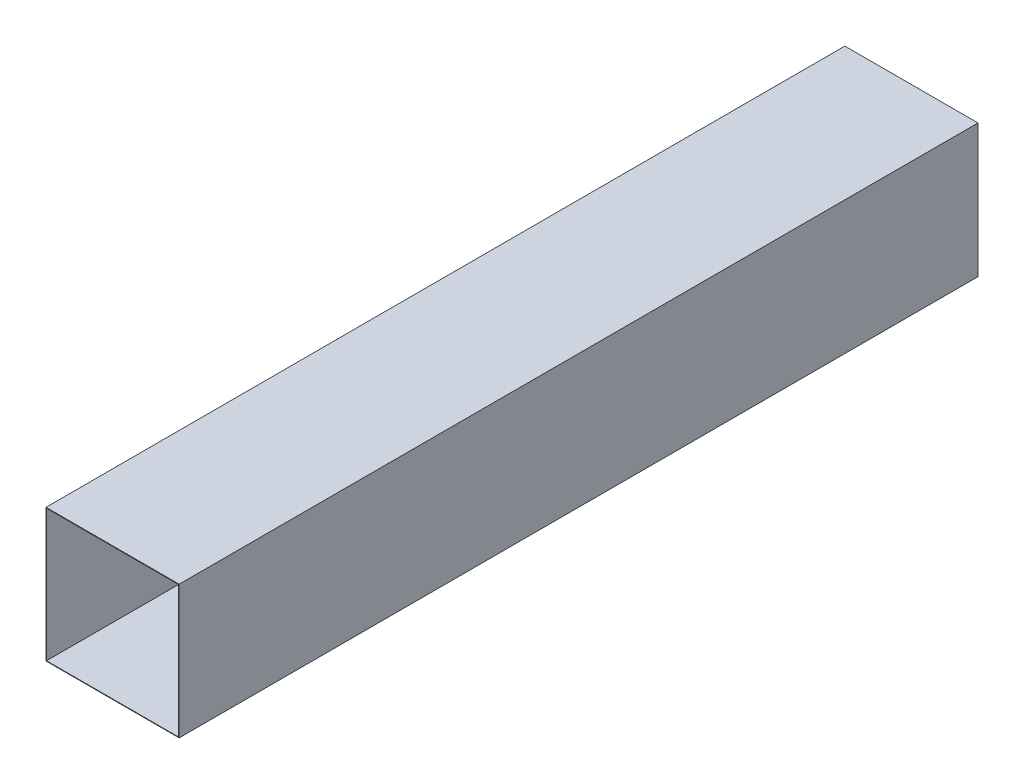
ISO-10303-21;
HEADER;
FILE_DESCRIPTION(('STEP AP214'),'2;1');
FILE_NAME('part.step','',(''),(''),'','','');
FILE_SCHEMA(('AUTOMOTIVE_DESIGN { 1 0 10303 214 1 1 1 1 }'));
ENDSEC;
DATA;
#1=APPLICATION_CONTEXT('core data for automotive mechanical design processes');
#2=APPLICATION_PROTOCOL_DEFINITION('international standard','automotive_design',2000,#1);
#3=PRODUCT_CONTEXT('',#1,'mechanical');
#4=PRODUCT('Part','Part','',(#3));
#5=PRODUCT_RELATED_PRODUCT_CATEGORY('part','',(#4));
#6=PRODUCT_DEFINITION_FORMATION('','',#4);
#7=PRODUCT_DEFINITION_CONTEXT('part definition',#1,'design');
#8=PRODUCT_DEFINITION('design','',#6,#7);
#9=PRODUCT_DEFINITION_SHAPE('','',#8);
#10=(LENGTH_UNIT() NAMED_UNIT(*) SI_UNIT(.MILLI.,.METRE.));
#11=(NAMED_UNIT(*) PLANE_ANGLE_UNIT() SI_UNIT($,.RADIAN.));
#12=(NAMED_UNIT(*) SI_UNIT($,.STERADIAN.) SOLID_ANGLE_UNIT());
#13=UNCERTAINTY_MEASURE_WITH_UNIT(LENGTH_MEASURE(1.E-05),#10,'distance_accuracy_value','');
#14=(GEOMETRIC_REPRESENTATION_CONTEXT(3) GLOBAL_UNCERTAINTY_ASSIGNED_CONTEXT((#13)) GLOBAL_UNIT_ASSIGNED_CONTEXT((#10,
#11,#12)) REPRESENTATION_CONTEXT('',''));
#15=CARTESIAN_POINT('',(0.,0.,0.));
#16=DIRECTION('',(0.,0.,1.));
#17=DIRECTION('',(1.,0.,0.));
#18=AXIS2_PLACEMENT_3D('',#15,#16,#17);
#19=CARTESIAN_POINT('',(0.,0.,3000.));
#20=DIRECTION('',(0.,0.,1.));
#21=DIRECTION('',(1.,0.,0.));
#22=AXIS2_PLACEMENT_3D('',#19,#20,#21);
#23=PLANE('',#22);
#24=DIRECTION('',(0.,1.,0.));
#25=VECTOR('',#24,1.);
#26=CARTESIAN_POINT('',(250.,250.,3000.));
#27=LINE('',#26,#25);
#28=CARTESIAN_POINT('',(250.,-250.,3000.));
#29=VERTEX_POINT('',#28);
#30=CARTESIAN_POINT('',(250.,250.,3000.));
#31=VERTEX_POINT('',#30);
#32=EDGE_CURVE('E157',#29,#31,#27,.T.);
#33=ORIENTED_EDGE('',*,*,#32,.T.);
#34=DIRECTION('',(-1.,0.,0.));
#35=VECTOR('',#34,1.);
#36=CARTESIAN_POINT('',(-250.,250.,3000.));
#37=LINE('',#36,#35);
#38=CARTESIAN_POINT('',(-250.,250.,3000.));
#39=VERTEX_POINT('',#38);
#40=EDGE_CURVE('E160',#31,#39,#37,.T.);
#41=ORIENTED_EDGE('',*,*,#40,.T.);
#42=DIRECTION('',(0.,-1.,0.));
#43=VECTOR('',#42,1.);
#44=CARTESIAN_POINT('',(-250.,250.,3000.));
#45=LINE('',#44,#43);
#46=CARTESIAN_POINT('',(-250.,-250.,3000.));
#47=VERTEX_POINT('',#46);
#48=EDGE_CURVE('E163',#39,#47,#45,.T.);
#49=ORIENTED_EDGE('',*,*,#48,.T.);
#50=DIRECTION('',(1.,0.,0.));
#51=VECTOR('',#50,1.);
#52=CARTESIAN_POINT('',(-250.,-250.,3000.));
#53=LINE('',#52,#51);
#54=EDGE_CURVE('E165',#47,#29,#53,.T.);
#55=ORIENTED_EDGE('',*,*,#54,.T.);
#56=EDGE_LOOP('',(#33,#41,#49,#55));
#57=FACE_BOUND('',#56,.T.);
#58=DIRECTION('',(-1.,0.,0.));
#59=VECTOR('',#58,1.);
#60=CARTESIAN_POINT('',(-250.,248.,3000.));
#61=LINE('',#60,#59);
#62=CARTESIAN_POINT('',(248.,248.,3000.));
#63=VERTEX_POINT('',#62);
#64=CARTESIAN_POINT('',(-248.,248.,3000.));
#65=VERTEX_POINT('',#64);
#66=EDGE_CURVE('E129',#63,#65,#61,.T.);
#67=ORIENTED_EDGE('',*,*,#66,.F.);
#68=DIRECTION('',(0.,1.,0.));
#69=VECTOR('',#68,1.);
#70=CARTESIAN_POINT('',(248.,250.,3000.));
#71=LINE('',#70,#69);
#72=CARTESIAN_POINT('',(248.,-248.,3000.));
#73=VERTEX_POINT('',#72);
#74=EDGE_CURVE('E121',#73,#63,#71,.T.);
#75=ORIENTED_EDGE('',*,*,#74,.F.);
#76=DIRECTION('',(1.,0.,0.));
#77=VECTOR('',#76,1.);
#78=CARTESIAN_POINT('',(-250.,-248.,3000.));
#79=LINE('',#78,#77);
#80=CARTESIAN_POINT('',(-248.,-248.,3000.));
#81=VERTEX_POINT('',#80);
#82=EDGE_CURVE('E143',#81,#73,#79,.T.);
#83=ORIENTED_EDGE('',*,*,#82,.F.);
#84=DIRECTION('',(0.,-1.,0.));
#85=VECTOR('',#84,1.);
#86=CARTESIAN_POINT('',(-248.,250.,3000.));
#87=LINE('',#86,#85);
#88=EDGE_CURVE('E141',#65,#81,#87,.T.);
#89=ORIENTED_EDGE('',*,*,#88,.F.);
#90=EDGE_LOOP('',(#67,#75,#83,#89));
#91=FACE_BOUND('',#90,.T.);
#92=ADVANCED_FACE('F56',(#57,#91),#23,.T.);
#93=CARTESIAN_POINT('',(0.,0.,0.));
#94=DIRECTION('',(0.,0.,1.));
#95=DIRECTION('',(1.,0.,0.));
#96=AXIS2_PLACEMENT_3D('',#93,#94,#95);
#97=PLANE('',#96);
#98=DIRECTION('',(0.,1.,0.));
#99=VECTOR('',#98,1.);
#100=CARTESIAN_POINT('',(250.,250.,0.));
#101=LINE('',#100,#99);
#102=CARTESIAN_POINT('',(250.,-250.,0.));
#103=VERTEX_POINT('',#102);
#104=CARTESIAN_POINT('',(250.,250.,0.));
#105=VERTEX_POINT('',#104);
#106=EDGE_CURVE('E137',#103,#105,#101,.T.);
#107=ORIENTED_EDGE('',*,*,#106,.F.);
#108=DIRECTION('',(1.,0.,0.));
#109=VECTOR('',#108,1.);
#110=CARTESIAN_POINT('',(-250.,-250.,0.));
#111=LINE('',#110,#109);
#112=CARTESIAN_POINT('',(-250.,-250.,0.));
#113=VERTEX_POINT('',#112);
#114=EDGE_CURVE('E161',#113,#103,#111,.T.);
#115=ORIENTED_EDGE('',*,*,#114,.F.);
#116=DIRECTION('',(0.,-1.,0.));
#117=VECTOR('',#116,1.);
#118=CARTESIAN_POINT('',(-250.,250.,0.));
#119=LINE('',#118,#117);
#120=CARTESIAN_POINT('',(-250.,250.,0.));
#121=VERTEX_POINT('',#120);
#122=EDGE_CURVE('E172',#121,#113,#119,.T.);
#123=ORIENTED_EDGE('',*,*,#122,.F.);
#124=DIRECTION('',(-1.,0.,0.));
#125=VECTOR('',#124,1.);
#126=CARTESIAN_POINT('',(-250.,250.,0.));
#127=LINE('',#126,#125);
#128=EDGE_CURVE('E170',#105,#121,#127,.T.);
#129=ORIENTED_EDGE('',*,*,#128,.F.);
#130=EDGE_LOOP('',(#107,#115,#123,#129));
#131=FACE_BOUND('',#130,.T.);
#132=DIRECTION('',(0.,1.,0.));
#133=VECTOR('',#132,1.);
#134=CARTESIAN_POINT('',(248.,250.,0.));
#135=LINE('',#134,#133);
#136=CARTESIAN_POINT('',(248.,-248.,0.));
#137=VERTEX_POINT('',#136);
#138=CARTESIAN_POINT('',(248.,248.,0.));
#139=VERTEX_POINT('',#138);
#140=EDGE_CURVE('E79',#137,#139,#135,.T.);
#141=ORIENTED_EDGE('',*,*,#140,.T.);
#142=DIRECTION('',(-1.,0.,0.));
#143=VECTOR('',#142,1.);
#144=CARTESIAN_POINT('',(-250.,248.,0.));
#145=LINE('',#144,#143);
#146=CARTESIAN_POINT('',(-248.,248.,0.));
#147=VERTEX_POINT('',#146);
#148=EDGE_CURVE('E136',#139,#147,#145,.T.);
#149=ORIENTED_EDGE('',*,*,#148,.T.);
#150=DIRECTION('',(0.,-1.,0.));
#151=VECTOR('',#150,1.);
#152=CARTESIAN_POINT('',(-248.,250.,0.));
#153=LINE('',#152,#151);
#154=CARTESIAN_POINT('',(-248.,-248.,0.));
#155=VERTEX_POINT('',#154);
#156=EDGE_CURVE('E149',#147,#155,#153,.T.);
#157=ORIENTED_EDGE('',*,*,#156,.T.);
#158=DIRECTION('',(1.,0.,0.));
#159=VECTOR('',#158,1.);
#160=CARTESIAN_POINT('',(-250.,-248.,0.));
#161=LINE('',#160,#159);
#162=EDGE_CURVE('E130',#155,#137,#161,.T.);
#163=ORIENTED_EDGE('',*,*,#162,.T.);
#164=EDGE_LOOP('',(#141,#149,#157,#163));
#165=FACE_BOUND('',#164,.T.);
#166=ADVANCED_FACE('F190',(#131,#165),#97,.F.);
#167=CARTESIAN_POINT('',(250.,250.,3000.));
#168=DIRECTION('',(-1.,0.,0.));
#169=DIRECTION('',(0.,-1.,0.));
#170=AXIS2_PLACEMENT_3D('',#167,#168,#169);
#171=PLANE('',#170);
#172=ORIENTED_EDGE('',*,*,#106,.T.);
#173=DIRECTION('',(0.,0.,-1.));
#174=VECTOR('',#173,1.);
#175=CARTESIAN_POINT('',(250.,250.,3000.));
#176=LINE('',#175,#174);
#177=EDGE_CURVE('E12',#31,#105,#176,.T.);
#178=ORIENTED_EDGE('',*,*,#177,.F.);
#179=ORIENTED_EDGE('',*,*,#32,.F.);
#180=DIRECTION('',(0.,0.,-1.));
#181=VECTOR('',#180,1.);
#182=CARTESIAN_POINT('',(250.,-250.,3000.));
#183=LINE('',#182,#181);
#184=EDGE_CURVE('E167',#29,#103,#183,.T.);
#185=ORIENTED_EDGE('',*,*,#184,.T.);
#186=EDGE_LOOP('',(#172,#178,#179,#185));
#187=FACE_BOUND('',#186,.T.);
#188=ADVANCED_FACE('F58',(#187),#171,.F.);
#189=CARTESIAN_POINT('',(-250.,250.,3000.));
#190=DIRECTION('',(0.,-1.,0.));
#191=DIRECTION('',(0.,0.,-1.));
#192=AXIS2_PLACEMENT_3D('',#189,#190,#191);
#193=PLANE('',#192);
#194=ORIENTED_EDGE('',*,*,#128,.T.);
#195=DIRECTION('',(0.,0.,-1.));
#196=VECTOR('',#195,1.);
#197=CARTESIAN_POINT('',(-250.,250.,3000.));
#198=LINE('',#197,#196);
#199=EDGE_CURVE('E64',#39,#121,#198,.T.);
#200=ORIENTED_EDGE('',*,*,#199,.F.);
#201=ORIENTED_EDGE('',*,*,#40,.F.);
#202=ORIENTED_EDGE('',*,*,#177,.T.);
#203=EDGE_LOOP('',(#194,#200,#201,#202));
#204=FACE_BOUND('',#203,.T.);
#205=ADVANCED_FACE('F200',(#204),#193,.F.);
#206=CARTESIAN_POINT('',(-250.,250.,3000.));
#207=DIRECTION('',(1.,0.,0.));
#208=DIRECTION('',(0.,1.,0.));
#209=AXIS2_PLACEMENT_3D('',#206,#207,#208);
#210=PLANE('',#209);
#211=ORIENTED_EDGE('',*,*,#122,.T.);
#212=DIRECTION('',(0.,0.,-1.));
#213=VECTOR('',#212,1.);
#214=CARTESIAN_POINT('',(-250.,-250.,3000.));
#215=LINE('',#214,#213);
#216=EDGE_CURVE('E177',#47,#113,#215,.T.);
#217=ORIENTED_EDGE('',*,*,#216,.F.);
#218=ORIENTED_EDGE('',*,*,#48,.F.);
#219=ORIENTED_EDGE('',*,*,#199,.T.);
#220=EDGE_LOOP('',(#211,#217,#218,#219));
#221=FACE_BOUND('',#220,.T.);
#222=ADVANCED_FACE('F184',(#221),#210,.F.);
#223=CARTESIAN_POINT('',(-250.,-250.,3000.));
#224=DIRECTION('',(0.,1.,0.));
#225=DIRECTION('',(0.,0.,1.));
#226=AXIS2_PLACEMENT_3D('',#223,#224,#225);
#227=PLANE('',#226);
#228=ORIENTED_EDGE('',*,*,#114,.T.);
#229=ORIENTED_EDGE('',*,*,#184,.F.);
#230=ORIENTED_EDGE('',*,*,#54,.F.);
#231=ORIENTED_EDGE('',*,*,#216,.T.);
#232=EDGE_LOOP('',(#228,#229,#230,#231));
#233=FACE_BOUND('',#232,.T.);
#234=ADVANCED_FACE('F194',(#233),#227,.F.);
#235=CARTESIAN_POINT('',(248.,250.,3000.));
#236=DIRECTION('',(-1.,0.,0.));
#237=DIRECTION('',(0.,-1.,0.));
#238=AXIS2_PLACEMENT_3D('',#235,#236,#237);
#239=PLANE('',#238);
#240=ORIENTED_EDGE('',*,*,#140,.F.);
#241=DIRECTION('',(0.,0.,-1.));
#242=VECTOR('',#241,1.);
#243=CARTESIAN_POINT('',(248.,-248.,3000.));
#244=LINE('',#243,#242);
#245=EDGE_CURVE('E125',#73,#137,#244,.T.);
#246=ORIENTED_EDGE('',*,*,#245,.F.);
#247=ORIENTED_EDGE('',*,*,#74,.T.);
#248=DIRECTION('',(0.,0.,-1.));
#249=VECTOR('',#248,1.);
#250=CARTESIAN_POINT('',(248.,248.,3000.));
#251=LINE('',#250,#249);
#252=EDGE_CURVE('E124',#63,#139,#251,.T.);
#253=ORIENTED_EDGE('',*,*,#252,.T.);
#254=EDGE_LOOP('',(#240,#246,#247,#253));
#255=FACE_BOUND('',#254,.T.);
#256=ADVANCED_FACE('F123',(#255),#239,.T.);
#257=CARTESIAN_POINT('',(-250.,248.,3000.));
#258=DIRECTION('',(0.,-1.,0.));
#259=DIRECTION('',(0.,0.,-1.));
#260=AXIS2_PLACEMENT_3D('',#257,#258,#259);
#261=PLANE('',#260);
#262=ORIENTED_EDGE('',*,*,#148,.F.);
#263=ORIENTED_EDGE('',*,*,#252,.F.);
#264=ORIENTED_EDGE('',*,*,#66,.T.);
#265=DIRECTION('',(0.,0.,-1.));
#266=VECTOR('',#265,1.);
#267=CARTESIAN_POINT('',(-248.,248.,3000.));
#268=LINE('',#267,#266);
#269=EDGE_CURVE('E138',#65,#147,#268,.T.);
#270=ORIENTED_EDGE('',*,*,#269,.T.);
#271=EDGE_LOOP('',(#262,#263,#264,#270));
#272=FACE_BOUND('',#271,.T.);
#273=ADVANCED_FACE('F133',(#272),#261,.T.);
#274=CARTESIAN_POINT('',(-248.,250.,3000.));
#275=DIRECTION('',(1.,0.,0.));
#276=DIRECTION('',(0.,1.,0.));
#277=AXIS2_PLACEMENT_3D('',#274,#275,#276);
#278=PLANE('',#277);
#279=ORIENTED_EDGE('',*,*,#156,.F.);
#280=ORIENTED_EDGE('',*,*,#269,.F.);
#281=ORIENTED_EDGE('',*,*,#88,.T.);
#282=DIRECTION('',(0.,0.,-1.));
#283=VECTOR('',#282,1.);
#284=CARTESIAN_POINT('',(-248.,-248.,3000.));
#285=LINE('',#284,#283);
#286=EDGE_CURVE('E71',#81,#155,#285,.T.);
#287=ORIENTED_EDGE('',*,*,#286,.T.);
#288=EDGE_LOOP('',(#279,#280,#281,#287));
#289=FACE_BOUND('',#288,.T.);
#290=ADVANCED_FACE('F223',(#289),#278,.T.);
#291=CARTESIAN_POINT('',(-250.,-248.,3000.));
#292=DIRECTION('',(0.,1.,0.));
#293=DIRECTION('',(0.,0.,1.));
#294=AXIS2_PLACEMENT_3D('',#291,#292,#293);
#295=PLANE('',#294);
#296=ORIENTED_EDGE('',*,*,#162,.F.);
#297=ORIENTED_EDGE('',*,*,#286,.F.);
#298=ORIENTED_EDGE('',*,*,#82,.T.);
#299=ORIENTED_EDGE('',*,*,#245,.T.);
#300=EDGE_LOOP('',(#296,#297,#298,#299));
#301=FACE_BOUND('',#300,.T.);
#302=ADVANCED_FACE('F227',(#301),#295,.T.);
#303=CLOSED_SHELL('',(#92,#166,#188,#205,#222,#234,#256,#273,#290,#302));
#304=MANIFOLD_SOLID_BREP('B2',#303);
#305=ADVANCED_BREP_SHAPE_REPRESENTATION('',(#18,#304),#14);
#306=SHAPE_DEFINITION_REPRESENTATION(#9,#305);
ENDSEC;
END-ISO-10303-21;
